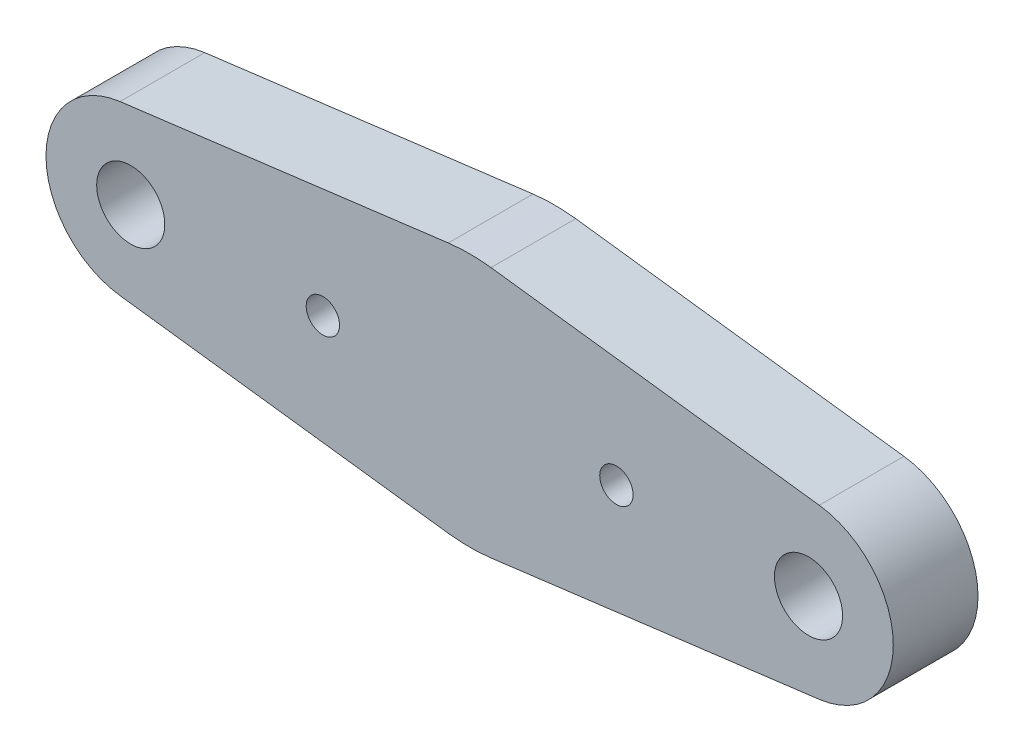
ISO-10303-21;
HEADER;
FILE_DESCRIPTION(('STEP AP214'),'2;1');
FILE_NAME('part.step','',(''),(''),'','','');
FILE_SCHEMA(('AUTOMOTIVE_DESIGN { 1 0 10303 214 1 1 1 1 }'));
ENDSEC;
DATA;
#1=APPLICATION_CONTEXT('core data for automotive mechanical design processes');
#2=APPLICATION_PROTOCOL_DEFINITION('international standard','automotive_design',2000,#1);
#3=PRODUCT_CONTEXT('',#1,'mechanical');
#4=PRODUCT('Part','Part','',(#3));
#5=PRODUCT_RELATED_PRODUCT_CATEGORY('part','',(#4));
#6=PRODUCT_DEFINITION_FORMATION('','',#4);
#7=PRODUCT_DEFINITION_CONTEXT('part definition',#1,'design');
#8=PRODUCT_DEFINITION('design','',#6,#7);
#9=PRODUCT_DEFINITION_SHAPE('','',#8);
#10=(LENGTH_UNIT() NAMED_UNIT(*) SI_UNIT(.MILLI.,.METRE.));
#11=(NAMED_UNIT(*) PLANE_ANGLE_UNIT() SI_UNIT($,.RADIAN.));
#12=(NAMED_UNIT(*) SI_UNIT($,.STERADIAN.) SOLID_ANGLE_UNIT());
#13=UNCERTAINTY_MEASURE_WITH_UNIT(LENGTH_MEASURE(1.E-05),#10,'distance_accuracy_value','');
#14=(GEOMETRIC_REPRESENTATION_CONTEXT(3) GLOBAL_UNCERTAINTY_ASSIGNED_CONTEXT((#13)) GLOBAL_UNIT_ASSIGNED_CONTEXT((#10,
#11,#12)) REPRESENTATION_CONTEXT('',''));
#15=CARTESIAN_POINT('',(0.,0.,0.));
#16=DIRECTION('',(0.,0.,1.));
#17=DIRECTION('',(1.,0.,0.));
#18=AXIS2_PLACEMENT_3D('',#15,#16,#17);
#19=CARTESIAN_POINT('',(0.,-3.175,0.));
#20=DIRECTION('',(0.,0.,1.));
#21=DIRECTION('',(1.,0.,0.));
#22=AXIS2_PLACEMENT_3D('',#19,#20,#21);
#23=PLANE('',#22);
#24=CARTESIAN_POINT('',(-25.4,0.,0.));
#25=DIRECTION('',(0.,0.,-1.));
#26=DIRECTION('',(-1.,0.,0.));
#27=AXIS2_PLACEMENT_3D('',#24,#25,#26);
#28=CIRCLE('',#27,2.5527);
#29=CARTESIAN_POINT('',(-27.9527,0.,0.));
#30=VERTEX_POINT('',#29);
#31=EDGE_CURVE('E265',#30,#30,#28,.T.);
#32=ORIENTED_EDGE('',*,*,#31,.F.);
#33=EDGE_LOOP('',(#32));
#34=FACE_BOUND('',#33,.T.);
#35=CARTESIAN_POINT('',(25.4,0.,0.));
#36=DIRECTION('',(0.,0.,-1.));
#37=DIRECTION('',(-1.,0.,0.));
#38=AXIS2_PLACEMENT_3D('',#35,#36,#37);
#39=CIRCLE('',#38,2.5527);
#40=CARTESIAN_POINT('',(22.8473,0.,0.));
#41=VERTEX_POINT('',#40);
#42=EDGE_CURVE('E257',#41,#41,#39,.T.);
#43=ORIENTED_EDGE('',*,*,#42,.F.);
#44=EDGE_LOOP('',(#43));
#45=FACE_BOUND('',#44,.T.);
#46=CARTESIAN_POINT('',(0.,-3.175,0.));
#47=DIRECTION('',(0.,0.,1.));
#48=DIRECTION('',(1.,0.,0.));
#49=AXIS2_PLACEMENT_3D('',#46,#47,#48);
#50=CIRCLE('',#49,12.7);
#51=CARTESIAN_POINT('',(1.60015121716901,9.42379026264794,0.));
#52=VERTEX_POINT('',#51);
#53=CARTESIAN_POINT('',(-1.60015121716901,9.42379026264794,0.));
#54=VERTEX_POINT('',#53);
#55=EDGE_CURVE('E172',#52,#54,#50,.T.);
#56=ORIENTED_EDGE('',*,*,#55,.F.);
#57=DIRECTION('',(-0.992030729342357,0.125996158832206,0.));
#58=VECTOR('',#57,1.);
#59=CARTESIAN_POINT('',(1.60015121716901,9.42379026264794,0.));
#60=LINE('',#59,#58);
#61=CARTESIAN_POINT('',(26.2000756085845,6.29939513132396,0.));
#62=VERTEX_POINT('',#61);
#63=EDGE_CURVE('E117',#62,#52,#60,.T.);
#64=ORIENTED_EDGE('',*,*,#63,.F.);
#65=CARTESIAN_POINT('',(25.4,0.,0.));
#66=DIRECTION('',(0.,0.,1.));
#67=DIRECTION('',(-1.,0.,0.));
#68=AXIS2_PLACEMENT_3D('',#65,#66,#67);
#69=CIRCLE('',#68,6.35);
#70=CARTESIAN_POINT('',(26.2000756085845,-6.29939513132397,0.));
#71=VERTEX_POINT('',#70);
#72=EDGE_CURVE('E110',#71,#62,#69,.T.);
#73=ORIENTED_EDGE('',*,*,#72,.F.);
#74=DIRECTION('',(0.992030729342357,0.125996158832205,0.));
#75=VECTOR('',#74,1.);
#76=CARTESIAN_POINT('',(26.2000756085845,-6.29939513132397,0.));
#77=LINE('',#76,#75);
#78=CARTESIAN_POINT('',(1.600151217169,-9.42379026264794,0.));
#79=VERTEX_POINT('',#78);
#80=EDGE_CURVE('E158',#79,#71,#77,.T.);
#81=ORIENTED_EDGE('',*,*,#80,.F.);
#82=CARTESIAN_POINT('',(0.,3.175,0.));
#83=DIRECTION('',(0.,0.,1.));
#84=DIRECTION('',(-1.,0.,0.));
#85=AXIS2_PLACEMENT_3D('',#82,#83,#84);
#86=CIRCLE('',#85,12.7);
#87=CARTESIAN_POINT('',(-1.600151217169,-9.42379026264794,0.));
#88=VERTEX_POINT('',#87);
#89=EDGE_CURVE('E186',#88,#79,#86,.T.);
#90=ORIENTED_EDGE('',*,*,#89,.F.);
#91=DIRECTION('',(0.992030729342357,-0.125996158832205,0.));
#92=VECTOR('',#91,1.);
#93=CARTESIAN_POINT('',(-26.2000756085845,-6.29939513132397,0.));
#94=LINE('',#93,#92);
#95=CARTESIAN_POINT('',(-26.2000756085845,-6.29939513132397,0.));
#96=VERTEX_POINT('',#95);
#97=EDGE_CURVE('E183',#96,#88,#94,.T.);
#98=ORIENTED_EDGE('',*,*,#97,.F.);
#99=CARTESIAN_POINT('',(-25.4,0.,0.));
#100=DIRECTION('',(0.,0.,1.));
#101=DIRECTION('',(1.,0.,0.));
#102=AXIS2_PLACEMENT_3D('',#99,#100,#101);
#103=CIRCLE('',#102,6.35);
#104=CARTESIAN_POINT('',(-26.2000756085845,6.29939513132396,0.));
#105=VERTEX_POINT('',#104);
#106=EDGE_CURVE('E180',#105,#96,#103,.T.);
#107=ORIENTED_EDGE('',*,*,#106,.F.);
#108=DIRECTION('',(-0.992030729342357,-0.125996158832206,0.));
#109=VECTOR('',#108,1.);
#110=CARTESIAN_POINT('',(-1.60015121716901,9.42379026264794,0.));
#111=LINE('',#110,#109);
#112=EDGE_CURVE('E176',#54,#105,#111,.T.);
#113=ORIENTED_EDGE('',*,*,#112,.F.);
#114=EDGE_LOOP('',(#56,#64,#73,#81,#90,#98,#107,#113));
#115=FACE_BOUND('',#114,.T.);
#116=CARTESIAN_POINT('',(-11.,0.,0.));
#117=DIRECTION('',(0.,0.,-1.));
#118=DIRECTION('',(-1.,0.,0.));
#119=AXIS2_PLACEMENT_3D('',#116,#117,#118);
#120=CIRCLE('',#119,1.25);
#121=CARTESIAN_POINT('',(-12.25,0.,0.));
#122=VERTEX_POINT('',#121);
#123=EDGE_CURVE('E244',#122,#122,#120,.T.);
#124=ORIENTED_EDGE('',*,*,#123,.F.);
#125=EDGE_LOOP('',(#124));
#126=FACE_BOUND('',#125,.T.);
#127=CARTESIAN_POINT('',(11.,0.,0.));
#128=DIRECTION('',(0.,0.,-1.));
#129=DIRECTION('',(-1.,0.,0.));
#130=AXIS2_PLACEMENT_3D('',#127,#128,#129);
#131=CIRCLE('',#130,1.25);
#132=CARTESIAN_POINT('',(9.75,0.,0.));
#133=VERTEX_POINT('',#132);
#134=EDGE_CURVE('E250',#133,#133,#131,.T.);
#135=ORIENTED_EDGE('',*,*,#134,.F.);
#136=EDGE_LOOP('',(#135));
#137=FACE_BOUND('',#136,.T.);
#138=ADVANCED_FACE('F53',(#34,#45,#115,#126,#137),#23,.F.);
#139=CARTESIAN_POINT('',(0.,-3.175,6.35));
#140=DIRECTION('',(0.,0.,-1.));
#141=DIRECTION('',(-1.,0.,0.));
#142=AXIS2_PLACEMENT_3D('',#139,#140,#141);
#143=CYLINDRICAL_SURFACE('',#142,12.7);
#144=ORIENTED_EDGE('',*,*,#55,.T.);
#145=DIRECTION('',(0.,0.,-1.));
#146=VECTOR('',#145,1.);
#147=CARTESIAN_POINT('',(-1.60015121716901,9.42379026264794,6.35));
#148=LINE('',#147,#146);
#149=CARTESIAN_POINT('',(-1.60015121716901,9.42379026264794,6.35));
#150=VERTEX_POINT('',#149);
#151=EDGE_CURVE('E11',#150,#54,#148,.T.);
#152=ORIENTED_EDGE('',*,*,#151,.F.);
#153=CARTESIAN_POINT('',(0.,-3.175,6.35));
#154=DIRECTION('',(0.,0.,1.));
#155=DIRECTION('',(1.,0.,0.));
#156=AXIS2_PLACEMENT_3D('',#153,#154,#155);
#157=CIRCLE('',#156,12.7);
#158=CARTESIAN_POINT('',(1.60015121716901,9.42379026264794,6.35));
#159=VERTEX_POINT('',#158);
#160=EDGE_CURVE('E195',#159,#150,#157,.T.);
#161=ORIENTED_EDGE('',*,*,#160,.F.);
#162=DIRECTION('',(0.,0.,-1.));
#163=VECTOR('',#162,1.);
#164=CARTESIAN_POINT('',(1.60015121716901,9.42379026264794,6.35));
#165=LINE('',#164,#163);
#166=EDGE_CURVE('E168',#159,#52,#165,.T.);
#167=ORIENTED_EDGE('',*,*,#166,.T.);
#168=EDGE_LOOP('',(#144,#152,#161,#167));
#169=FACE_BOUND('',#168,.T.);
#170=ADVANCED_FACE('F55',(#169),#143,.T.);
#171=CARTESIAN_POINT('',(-1.60015121716901,9.42379026264794,6.35));
#172=DIRECTION('',(0.125996158832206,-0.992030729342357,0.));
#173=DIRECTION('',(0.992030729342358,0.125996158832206,0.));
#174=AXIS2_PLACEMENT_3D('',#171,#172,#173);
#175=PLANE('',#174);
#176=ORIENTED_EDGE('',*,*,#112,.T.);
#177=DIRECTION('',(0.,0.,-1.));
#178=VECTOR('',#177,1.);
#179=CARTESIAN_POINT('',(-26.2000756085845,6.29939513132396,6.35));
#180=LINE('',#179,#178);
#181=CARTESIAN_POINT('',(-26.2000756085845,6.29939513132396,6.35));
#182=VERTEX_POINT('',#181);
#183=EDGE_CURVE('E63',#182,#105,#180,.T.);
#184=ORIENTED_EDGE('',*,*,#183,.F.);
#185=DIRECTION('',(-0.992030729342357,-0.125996158832206,0.));
#186=VECTOR('',#185,1.);
#187=CARTESIAN_POINT('',(-1.60015121716901,9.42379026264794,6.35));
#188=LINE('',#187,#186);
#189=EDGE_CURVE('E125',#150,#182,#188,.T.);
#190=ORIENTED_EDGE('',*,*,#189,.F.);
#191=ORIENTED_EDGE('',*,*,#151,.T.);
#192=EDGE_LOOP('',(#176,#184,#190,#191));
#193=FACE_BOUND('',#192,.T.);
#194=ADVANCED_FACE('F311',(#193),#175,.F.);
#195=CARTESIAN_POINT('',(-25.4,0.,6.35));
#196=DIRECTION('',(0.,0.,-1.));
#197=DIRECTION('',(-1.,0.,0.));
#198=AXIS2_PLACEMENT_3D('',#195,#196,#197);
#199=CYLINDRICAL_SURFACE('',#198,6.35);
#200=ORIENTED_EDGE('',*,*,#106,.T.);
#201=DIRECTION('',(0.,0.,-1.));
#202=VECTOR('',#201,1.);
#203=CARTESIAN_POINT('',(-26.2000756085845,-6.29939513132397,6.35));
#204=LINE('',#203,#202);
#205=CARTESIAN_POINT('',(-26.2000756085845,-6.29939513132397,6.35));
#206=VERTEX_POINT('',#205);
#207=EDGE_CURVE('E206',#206,#96,#204,.T.);
#208=ORIENTED_EDGE('',*,*,#207,.F.);
#209=CARTESIAN_POINT('',(-25.4,0.,6.35));
#210=DIRECTION('',(0.,0.,1.));
#211=DIRECTION('',(1.,0.,0.));
#212=AXIS2_PLACEMENT_3D('',#209,#210,#211);
#213=CIRCLE('',#212,6.35);
#214=EDGE_CURVE('E217',#182,#206,#213,.T.);
#215=ORIENTED_EDGE('',*,*,#214,.F.);
#216=ORIENTED_EDGE('',*,*,#183,.T.);
#217=EDGE_LOOP('',(#200,#208,#215,#216));
#218=FACE_BOUND('',#217,.T.);
#219=ADVANCED_FACE('F215',(#218),#199,.T.);
#220=CARTESIAN_POINT('',(-26.2000756085845,-6.29939513132397,6.35));
#221=DIRECTION('',(0.125996158832205,0.992030729342357,0.));
#222=DIRECTION('',(-0.992030729342357,0.125996158832205,0.));
#223=AXIS2_PLACEMENT_3D('',#220,#221,#222);
#224=PLANE('',#223);
#225=ORIENTED_EDGE('',*,*,#97,.T.);
#226=DIRECTION('',(0.,0.,-1.));
#227=VECTOR('',#226,1.);
#228=CARTESIAN_POINT('',(-1.600151217169,-9.42379026264794,6.35));
#229=LINE('',#228,#227);
#230=CARTESIAN_POINT('',(-1.600151217169,-9.42379026264794,6.35));
#231=VERTEX_POINT('',#230);
#232=EDGE_CURVE('E202',#231,#88,#229,.T.);
#233=ORIENTED_EDGE('',*,*,#232,.F.);
#234=DIRECTION('',(0.992030729342357,-0.125996158832205,0.));
#235=VECTOR('',#234,1.);
#236=CARTESIAN_POINT('',(-26.2000756085845,-6.29939513132397,6.35));
#237=LINE('',#236,#235);
#238=EDGE_CURVE('E230',#206,#231,#237,.T.);
#239=ORIENTED_EDGE('',*,*,#238,.F.);
#240=ORIENTED_EDGE('',*,*,#207,.T.);
#241=EDGE_LOOP('',(#225,#233,#239,#240));
#242=FACE_BOUND('',#241,.T.);
#243=ADVANCED_FACE('F225',(#242),#224,.F.);
#244=CARTESIAN_POINT('',(0.,3.175,6.35));
#245=DIRECTION('',(0.,0.,-1.));
#246=DIRECTION('',(-1.,0.,0.));
#247=AXIS2_PLACEMENT_3D('',#244,#245,#246);
#248=CYLINDRICAL_SURFACE('',#247,12.7);
#249=ORIENTED_EDGE('',*,*,#89,.T.);
#250=DIRECTION('',(0.,0.,-1.));
#251=VECTOR('',#250,1.);
#252=CARTESIAN_POINT('',(1.600151217169,-9.42379026264794,6.35));
#253=LINE('',#252,#251);
#254=CARTESIAN_POINT('',(1.600151217169,-9.42379026264794,6.35));
#255=VERTEX_POINT('',#254);
#256=EDGE_CURVE('E160',#255,#79,#253,.T.);
#257=ORIENTED_EDGE('',*,*,#256,.F.);
#258=CARTESIAN_POINT('',(0.,3.175,6.35));
#259=DIRECTION('',(0.,0.,1.));
#260=DIRECTION('',(-1.,0.,0.));
#261=AXIS2_PLACEMENT_3D('',#258,#259,#260);
#262=CIRCLE('',#261,12.7);
#263=EDGE_CURVE('E149',#231,#255,#262,.T.);
#264=ORIENTED_EDGE('',*,*,#263,.F.);
#265=ORIENTED_EDGE('',*,*,#232,.T.);
#266=EDGE_LOOP('',(#249,#257,#264,#265));
#267=FACE_BOUND('',#266,.T.);
#268=ADVANCED_FACE('F228',(#267),#248,.T.);
#269=CARTESIAN_POINT('',(26.2000756085845,-6.29939513132397,6.35));
#270=DIRECTION('',(-0.125996158832205,0.992030729342357,0.));
#271=DIRECTION('',(-0.992030729342357,-0.125996158832205,0.));
#272=AXIS2_PLACEMENT_3D('',#269,#270,#271);
#273=PLANE('',#272);
#274=ORIENTED_EDGE('',*,*,#80,.T.);
#275=DIRECTION('',(0.,0.,-1.));
#276=VECTOR('',#275,1.);
#277=CARTESIAN_POINT('',(26.2000756085845,-6.29939513132397,6.35));
#278=LINE('',#277,#276);
#279=CARTESIAN_POINT('',(26.2000756085845,-6.29939513132397,6.35));
#280=VERTEX_POINT('',#279);
#281=EDGE_CURVE('E155',#280,#71,#278,.T.);
#282=ORIENTED_EDGE('',*,*,#281,.F.);
#283=DIRECTION('',(0.992030729342357,0.125996158832205,0.));
#284=VECTOR('',#283,1.);
#285=CARTESIAN_POINT('',(26.2000756085845,-6.29939513132397,6.35));
#286=LINE('',#285,#284);
#287=EDGE_CURVE('E143',#255,#280,#286,.T.);
#288=ORIENTED_EDGE('',*,*,#287,.F.);
#289=ORIENTED_EDGE('',*,*,#256,.T.);
#290=EDGE_LOOP('',(#274,#282,#288,#289));
#291=FACE_BOUND('',#290,.T.);
#292=ADVANCED_FACE('F156',(#291),#273,.F.);
#293=CARTESIAN_POINT('',(25.4,0.,6.35));
#294=DIRECTION('',(0.,0.,-1.));
#295=DIRECTION('',(-1.,0.,0.));
#296=AXIS2_PLACEMENT_3D('',#293,#294,#295);
#297=CYLINDRICAL_SURFACE('',#296,6.35);
#298=ORIENTED_EDGE('',*,*,#72,.T.);
#299=DIRECTION('',(0.,0.,-1.));
#300=VECTOR('',#299,1.);
#301=CARTESIAN_POINT('',(26.2000756085845,6.29939513132396,6.35));
#302=LINE('',#301,#300);
#303=CARTESIAN_POINT('',(26.2000756085845,6.29939513132396,6.35));
#304=VERTEX_POINT('',#303);
#305=EDGE_CURVE('E161',#304,#62,#302,.T.);
#306=ORIENTED_EDGE('',*,*,#305,.F.);
#307=CARTESIAN_POINT('',(25.4,0.,6.35));
#308=DIRECTION('',(0.,0.,1.));
#309=DIRECTION('',(-1.,0.,0.));
#310=AXIS2_PLACEMENT_3D('',#307,#308,#309);
#311=CIRCLE('',#310,6.35);
#312=EDGE_CURVE('E147',#280,#304,#311,.T.);
#313=ORIENTED_EDGE('',*,*,#312,.F.);
#314=ORIENTED_EDGE('',*,*,#281,.T.);
#315=EDGE_LOOP('',(#298,#306,#313,#314));
#316=FACE_BOUND('',#315,.T.);
#317=ADVANCED_FACE('F163',(#316),#297,.T.);
#318=CARTESIAN_POINT('',(1.60015121716901,9.42379026264794,6.35));
#319=DIRECTION('',(-0.125996158832206,-0.992030729342357,0.));
#320=DIRECTION('',(0.992030729342358,-0.125996158832206,0.));
#321=AXIS2_PLACEMENT_3D('',#318,#319,#320);
#322=PLANE('',#321);
#323=ORIENTED_EDGE('',*,*,#63,.T.);
#324=ORIENTED_EDGE('',*,*,#166,.F.);
#325=DIRECTION('',(-0.992030729342357,0.125996158832206,0.));
#326=VECTOR('',#325,1.);
#327=CARTESIAN_POINT('',(1.60015121716901,9.42379026264794,6.35));
#328=LINE('',#327,#326);
#329=EDGE_CURVE('E74',#304,#159,#328,.T.);
#330=ORIENTED_EDGE('',*,*,#329,.F.);
#331=ORIENTED_EDGE('',*,*,#305,.T.);
#332=EDGE_LOOP('',(#323,#324,#330,#331));
#333=FACE_BOUND('',#332,.T.);
#334=ADVANCED_FACE('F297',(#333),#322,.F.);
#335=CARTESIAN_POINT('',(0.,-3.175,6.35));
#336=DIRECTION('',(0.,0.,1.));
#337=DIRECTION('',(1.,0.,0.));
#338=AXIS2_PLACEMENT_3D('',#335,#336,#337);
#339=PLANE('',#338);
#340=CARTESIAN_POINT('',(-25.4,0.,6.35));
#341=DIRECTION('',(0.,0.,-1.));
#342=DIRECTION('',(-1.,0.,0.));
#343=AXIS2_PLACEMENT_3D('',#340,#341,#342);
#344=CIRCLE('',#343,2.5527);
#345=CARTESIAN_POINT('',(-27.9527,0.,6.35));
#346=VERTEX_POINT('',#345);
#347=EDGE_CURVE('E261',#346,#346,#344,.T.);
#348=ORIENTED_EDGE('',*,*,#347,.T.);
#349=EDGE_LOOP('',(#348));
#350=FACE_BOUND('',#349,.T.);
#351=CARTESIAN_POINT('',(25.4,0.,6.35));
#352=DIRECTION('',(0.,0.,-1.));
#353=DIRECTION('',(-1.,0.,0.));
#354=AXIS2_PLACEMENT_3D('',#351,#352,#353);
#355=CIRCLE('',#354,2.5527);
#356=CARTESIAN_POINT('',(22.8473,0.,6.35));
#357=VERTEX_POINT('',#356);
#358=EDGE_CURVE('E253',#357,#357,#355,.T.);
#359=ORIENTED_EDGE('',*,*,#358,.T.);
#360=EDGE_LOOP('',(#359));
#361=FACE_BOUND('',#360,.T.);
#362=CARTESIAN_POINT('',(11.,0.,6.35));
#363=DIRECTION('',(0.,0.,1.));
#364=DIRECTION('',(1.,0.,0.));
#365=AXIS2_PLACEMENT_3D('',#362,#363,#364);
#366=CIRCLE('',#365,1.25);
#367=CARTESIAN_POINT('',(12.25,0.,6.35));
#368=VERTEX_POINT('',#367);
#369=EDGE_CURVE('E247',#368,#368,#366,.T.);
#370=ORIENTED_EDGE('',*,*,#369,.F.);
#371=EDGE_LOOP('',(#370));
#372=FACE_BOUND('',#371,.T.);
#373=CARTESIAN_POINT('',(-11.,0.,6.35));
#374=DIRECTION('',(0.,0.,1.));
#375=DIRECTION('',(1.,0.,0.));
#376=AXIS2_PLACEMENT_3D('',#373,#374,#375);
#377=CIRCLE('',#376,1.25);
#378=CARTESIAN_POINT('',(-9.75,0.,6.35));
#379=VERTEX_POINT('',#378);
#380=EDGE_CURVE('E177',#379,#379,#377,.T.);
#381=ORIENTED_EDGE('',*,*,#380,.F.);
#382=EDGE_LOOP('',(#381));
#383=FACE_BOUND('',#382,.T.);
#384=ORIENTED_EDGE('',*,*,#160,.T.);
#385=ORIENTED_EDGE('',*,*,#189,.T.);
#386=ORIENTED_EDGE('',*,*,#214,.T.);
#387=ORIENTED_EDGE('',*,*,#238,.T.);
#388=ORIENTED_EDGE('',*,*,#263,.T.);
#389=ORIENTED_EDGE('',*,*,#287,.T.);
#390=ORIENTED_EDGE('',*,*,#312,.T.);
#391=ORIENTED_EDGE('',*,*,#329,.T.);
#392=EDGE_LOOP('',(#384,#385,#386,#387,#388,#389,#390,#391));
#393=FACE_BOUND('',#392,.T.);
#394=ADVANCED_FACE('F145',(#350,#361,#372,#383,#393),#339,.T.);
#395=CARTESIAN_POINT('',(-11.,0.,0.));
#396=DIRECTION('',(0.,0.,-1.));
#397=DIRECTION('',(-1.,0.,0.));
#398=AXIS2_PLACEMENT_3D('',#395,#396,#397);
#399=CYLINDRICAL_SURFACE('',#398,1.25);
#400=ORIENTED_EDGE('',*,*,#123,.T.);
#401=EDGE_LOOP('',(#400));
#402=FACE_BOUND('',#401,.T.);
#403=ORIENTED_EDGE('',*,*,#380,.T.);
#404=EDGE_LOOP('',(#403));
#405=FACE_BOUND('',#404,.T.);
#406=ADVANCED_FACE('F289',(#402,#405),#399,.F.);
#407=CARTESIAN_POINT('',(11.,0.,0.));
#408=DIRECTION('',(0.,0.,-1.));
#409=DIRECTION('',(-1.,0.,0.));
#410=AXIS2_PLACEMENT_3D('',#407,#408,#409);
#411=CYLINDRICAL_SURFACE('',#410,1.25);
#412=ORIENTED_EDGE('',*,*,#134,.T.);
#413=EDGE_LOOP('',(#412));
#414=FACE_BOUND('',#413,.T.);
#415=ORIENTED_EDGE('',*,*,#369,.T.);
#416=EDGE_LOOP('',(#415));
#417=FACE_BOUND('',#416,.T.);
#418=ADVANCED_FACE('F279',(#414,#417),#411,.F.);
#419=CARTESIAN_POINT('',(25.4,0.,0.));
#420=DIRECTION('',(0.,0.,-1.));
#421=DIRECTION('',(-1.,0.,0.));
#422=AXIS2_PLACEMENT_3D('',#419,#420,#421);
#423=CYLINDRICAL_SURFACE('',#422,2.5527);
#424=ORIENTED_EDGE('',*,*,#358,.F.);
#425=EDGE_LOOP('',(#424));
#426=FACE_BOUND('',#425,.T.);
#427=ORIENTED_EDGE('',*,*,#42,.T.);
#428=EDGE_LOOP('',(#427));
#429=FACE_BOUND('',#428,.T.);
#430=ADVANCED_FACE('F277',(#426,#429),#423,.F.);
#431=CARTESIAN_POINT('',(-25.4,0.,0.));
#432=DIRECTION('',(0.,0.,-1.));
#433=DIRECTION('',(-1.,0.,0.));
#434=AXIS2_PLACEMENT_3D('',#431,#432,#433);
#435=CYLINDRICAL_SURFACE('',#434,2.5527);
#436=ORIENTED_EDGE('',*,*,#347,.F.);
#437=EDGE_LOOP('',(#436));
#438=FACE_BOUND('',#437,.T.);
#439=ORIENTED_EDGE('',*,*,#31,.T.);
#440=EDGE_LOOP('',(#439));
#441=FACE_BOUND('',#440,.T.);
#442=ADVANCED_FACE('F270',(#438,#441),#435,.F.);
#443=CLOSED_SHELL('',(#138,#170,#194,#219,#243,#268,#292,#317,#334,#394,#406,#418,#430,#442));
#444=MANIFOLD_SOLID_BREP('B2',#443);
#445=ADVANCED_BREP_SHAPE_REPRESENTATION('',(#18,#444),#14);
#446=SHAPE_DEFINITION_REPRESENTATION(#9,#445);
ENDSEC;
END-ISO-10303-21;
